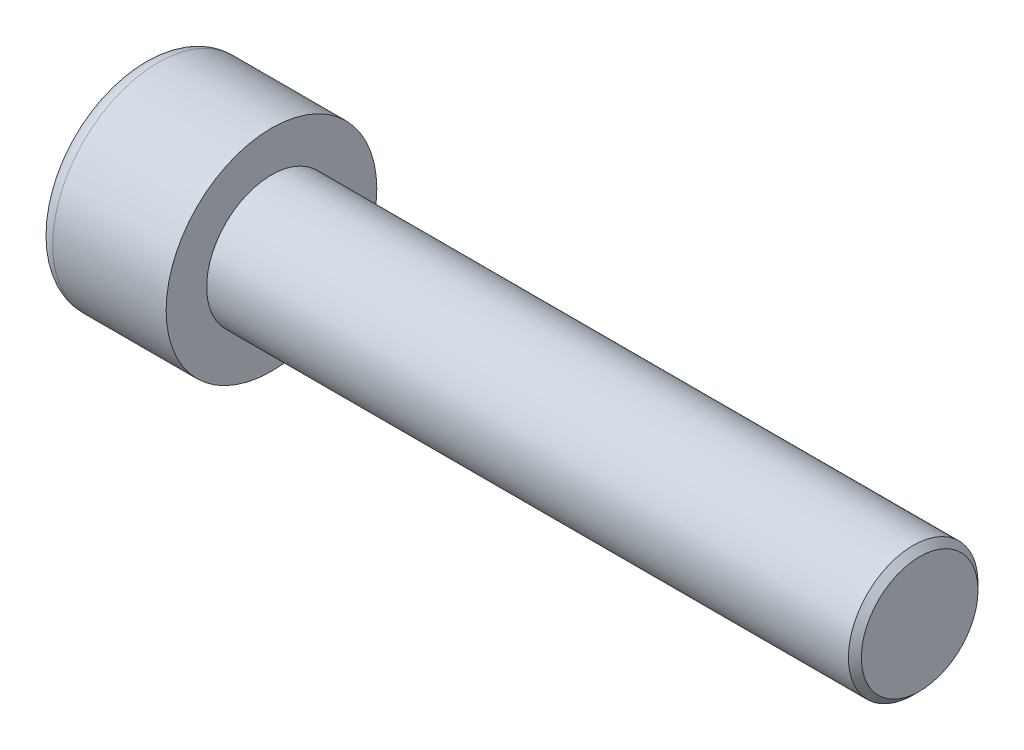
ISO-10303-21;
HEADER;
FILE_DESCRIPTION(('STEP AP214'),'2;1');
FILE_NAME('part.step','',(''),(''),'','','');
FILE_SCHEMA(('AUTOMOTIVE_DESIGN { 1 0 10303 214 1 1 1 1 }'));
ENDSEC;
DATA;
#1=APPLICATION_CONTEXT('core data for automotive mechanical design processes');
#2=APPLICATION_PROTOCOL_DEFINITION('international standard','automotive_design',2000,#1);
#3=PRODUCT_CONTEXT('',#1,'mechanical');
#4=PRODUCT('Part','Part','',(#3));
#5=PRODUCT_RELATED_PRODUCT_CATEGORY('part','',(#4));
#6=PRODUCT_DEFINITION_FORMATION('','',#4);
#7=PRODUCT_DEFINITION_CONTEXT('part definition',#1,'design');
#8=PRODUCT_DEFINITION('design','',#6,#7);
#9=PRODUCT_DEFINITION_SHAPE('','',#8);
#10=(LENGTH_UNIT() NAMED_UNIT(*) SI_UNIT(.MILLI.,.METRE.));
#11=(NAMED_UNIT(*) PLANE_ANGLE_UNIT() SI_UNIT($,.RADIAN.));
#12=(NAMED_UNIT(*) SI_UNIT($,.STERADIAN.) SOLID_ANGLE_UNIT());
#13=UNCERTAINTY_MEASURE_WITH_UNIT(LENGTH_MEASURE(1.E-05),#10,'distance_accuracy_value','');
#14=(GEOMETRIC_REPRESENTATION_CONTEXT(3) GLOBAL_UNCERTAINTY_ASSIGNED_CONTEXT((#13)) GLOBAL_UNIT_ASSIGNED_CONTEXT((#10,
#11,#12)) REPRESENTATION_CONTEXT('',''));
#15=CARTESIAN_POINT('',(0.,0.,0.));
#16=DIRECTION('',(0.,0.,1.));
#17=DIRECTION('',(1.,0.,0.));
#18=AXIS2_PLACEMENT_3D('',#15,#16,#17);
#19=CARTESIAN_POINT('',(4.,-6.,0.));
#20=DIRECTION('',(-1.,0.,0.));
#21=DIRECTION('',(0.,0.,1.));
#22=AXIS2_PLACEMENT_3D('',#19,#20,#21);
#23=PLANE('',#22);
#24=DIRECTION('',(0.,-0.866025403784438,-0.500000000000001));
#25=VECTOR('',#24,1.);
#26=CARTESIAN_POINT('',(4.,0.,3.46410161513776));
#27=LINE('',#26,#25);
#28=CARTESIAN_POINT('',(4.,-1.5,2.59807621135332));
#29=VERTEX_POINT('',#28);
#30=CARTESIAN_POINT('',(4.,-3.,1.73205080756888));
#31=VERTEX_POINT('',#30);
#32=EDGE_CURVE('E159',#29,#31,#27,.T.);
#33=ORIENTED_EDGE('',*,*,#32,.F.);
#34=CARTESIAN_POINT('',(4.,0.,0.));
#35=DIRECTION('',(-1.,0.,0.));
#36=DIRECTION('',(0.,0.,1.));
#37=AXIS2_PLACEMENT_3D('',#34,#35,#36);
#38=CIRCLE('',#37,3.);
#39=CARTESIAN_POINT('',(4.,-3.,0.));
#40=VERTEX_POINT('',#39);
#41=EDGE_CURVE('E54',#29,#40,#38,.F.);
#42=ORIENTED_EDGE('',*,*,#41,.T.);
#43=DIRECTION('',(0.,0.,-1.));
#44=VECTOR('',#43,1.);
#45=CARTESIAN_POINT('',(4.,-3.,1.73205080756888));
#46=LINE('',#45,#44);
#47=EDGE_CURVE('E164',#31,#40,#46,.T.);
#48=ORIENTED_EDGE('',*,*,#47,.F.);
#49=EDGE_LOOP('',(#33,#42,#48));
#50=FACE_BOUND('',#49,.T.);
#51=ADVANCED_FACE('F39',(#50),#23,.T.);
#52=CARTESIAN_POINT('',(4.,-3.,-1.73205080756888));
#53=VERTEX_POINT('',#52);
#54=EDGE_CURVE('E163',#40,#53,#46,.T.);
#55=ORIENTED_EDGE('',*,*,#54,.F.);
#56=CARTESIAN_POINT('',(4.,-1.5,-2.59807621135332));
#57=VERTEX_POINT('',#56);
#58=EDGE_CURVE('E139',#40,#57,#38,.F.);
#59=ORIENTED_EDGE('',*,*,#58,.T.);
#60=DIRECTION('',(0.,0.866025403784439,-0.5));
#61=VECTOR('',#60,1.);
#62=CARTESIAN_POINT('',(4.,-3.,-1.73205080756888));
#63=LINE('',#62,#61);
#64=EDGE_CURVE('E147',#53,#57,#63,.T.);
#65=ORIENTED_EDGE('',*,*,#64,.F.);
#66=EDGE_LOOP('',(#55,#59,#65));
#67=FACE_BOUND('',#66,.T.);
#68=ADVANCED_FACE('F220',(#67),#23,.T.);
#69=CARTESIAN_POINT('',(4.,0.,-3.46410161513776));
#70=VERTEX_POINT('',#69);
#71=EDGE_CURVE('E137',#57,#70,#63,.T.);
#72=ORIENTED_EDGE('',*,*,#71,.F.);
#73=CARTESIAN_POINT('',(4.,1.5,-2.59807621135332));
#74=VERTEX_POINT('',#73);
#75=EDGE_CURVE('E121',#57,#74,#38,.F.);
#76=ORIENTED_EDGE('',*,*,#75,.T.);
#77=DIRECTION('',(0.,0.866025403784439,0.5));
#78=VECTOR('',#77,1.);
#79=CARTESIAN_POINT('',(4.,0.,-3.46410161513776));
#80=LINE('',#79,#78);
#81=EDGE_CURVE('E135',#70,#74,#80,.T.);
#82=ORIENTED_EDGE('',*,*,#81,.F.);
#83=EDGE_LOOP('',(#72,#76,#82));
#84=FACE_BOUND('',#83,.T.);
#85=ADVANCED_FACE('F133',(#84),#23,.T.);
#86=CARTESIAN_POINT('',(4.,3.,-1.73205080756888));
#87=VERTEX_POINT('',#86);
#88=EDGE_CURVE('E141',#74,#87,#80,.T.);
#89=ORIENTED_EDGE('',*,*,#88,.F.);
#90=CARTESIAN_POINT('',(4.,0.,0.));
#91=DIRECTION('',(1.,0.,0.));
#92=DIRECTION('',(0.,0.,-1.));
#93=AXIS2_PLACEMENT_3D('',#90,#91,#92);
#94=CIRCLE('',#93,3.);
#95=CARTESIAN_POINT('',(4.,3.,0.));
#96=VERTEX_POINT('',#95);
#97=EDGE_CURVE('E119',#74,#96,#94,.T.);
#98=ORIENTED_EDGE('',*,*,#97,.T.);
#99=DIRECTION('',(0.,0.,1.));
#100=VECTOR('',#99,1.);
#101=CARTESIAN_POINT('',(4.,3.,-1.73205080756888));
#102=LINE('',#101,#100);
#103=EDGE_CURVE('E144',#87,#96,#102,.T.);
#104=ORIENTED_EDGE('',*,*,#103,.F.);
#105=EDGE_LOOP('',(#89,#98,#104));
#106=FACE_BOUND('',#105,.T.);
#107=ADVANCED_FACE('F142',(#106),#23,.T.);
#108=CARTESIAN_POINT('',(4.,3.,1.73205080756888));
#109=VERTEX_POINT('',#108);
#110=EDGE_CURVE('E151',#96,#109,#102,.T.);
#111=ORIENTED_EDGE('',*,*,#110,.F.);
#112=CARTESIAN_POINT('',(4.,1.5,2.59807621135332));
#113=VERTEX_POINT('',#112);
#114=EDGE_CURVE('E124',#96,#113,#38,.F.);
#115=ORIENTED_EDGE('',*,*,#114,.T.);
#116=DIRECTION('',(0.,-0.866025403784439,0.5));
#117=VECTOR('',#116,1.);
#118=CARTESIAN_POINT('',(4.,3.,1.73205080756888));
#119=LINE('',#118,#117);
#120=EDGE_CURVE('E156',#109,#113,#119,.T.);
#121=ORIENTED_EDGE('',*,*,#120,.F.);
#122=EDGE_LOOP('',(#111,#115,#121));
#123=FACE_BOUND('',#122,.T.);
#124=ADVANCED_FACE('F232',(#123),#23,.T.);
#125=CARTESIAN_POINT('',(4.,0.,3.46410161513776));
#126=VERTEX_POINT('',#125);
#127=EDGE_CURVE('E155',#113,#126,#119,.T.);
#128=ORIENTED_EDGE('',*,*,#127,.F.);
#129=EDGE_CURVE('E200',#113,#29,#38,.F.);
#130=ORIENTED_EDGE('',*,*,#129,.T.);
#131=EDGE_CURVE('E160',#126,#29,#27,.T.);
#132=ORIENTED_EDGE('',*,*,#131,.F.);
#133=EDGE_LOOP('',(#128,#130,#132));
#134=FACE_BOUND('',#133,.T.);
#135=ADVANCED_FACE('F223',(#134),#23,.T.);
#136=CARTESIAN_POINT('',(0.,0.,0.));
#137=DIRECTION('',(1.,0.,0.));
#138=DIRECTION('',(0.,0.,-1.));
#139=AXIS2_PLACEMENT_3D('',#136,#137,#138);
#140=PLANE('',#139);
#141=CARTESIAN_POINT('',(0.,0.,0.));
#142=DIRECTION('',(1.,0.,0.));
#143=DIRECTION('',(0.,0.,-1.));
#144=AXIS2_PLACEMENT_3D('',#141,#142,#143);
#145=CIRCLE('',#144,5.5);
#146=CARTESIAN_POINT('',(0.,0.,-5.5));
#147=VERTEX_POINT('',#146);
#148=EDGE_CURVE('E205',#147,#147,#145,.F.);
#149=ORIENTED_EDGE('',*,*,#148,.T.);
#150=EDGE_LOOP('',(#149));
#151=FACE_BOUND('',#150,.T.);
#152=DIRECTION('',(0.,0.866025403784439,-0.5));
#153=VECTOR('',#152,1.);
#154=CARTESIAN_POINT('',(0.,-3.,-1.73205080756888));
#155=LINE('',#154,#153);
#156=CARTESIAN_POINT('',(0.,-3.,-1.73205080756888));
#157=VERTEX_POINT('',#156);
#158=CARTESIAN_POINT('',(0.,0.,-3.46410161513776));
#159=VERTEX_POINT('',#158);
#160=EDGE_CURVE('E62',#157,#159,#155,.T.);
#161=ORIENTED_EDGE('',*,*,#160,.T.);
#162=DIRECTION('',(0.,0.866025403784439,0.5));
#163=VECTOR('',#162,1.);
#164=CARTESIAN_POINT('',(0.,0.,-3.46410161513776));
#165=LINE('',#164,#163);
#166=CARTESIAN_POINT('',(0.,3.,-1.73205080756888));
#167=VERTEX_POINT('',#166);
#168=EDGE_CURVE('E169',#159,#167,#165,.T.);
#169=ORIENTED_EDGE('',*,*,#168,.T.);
#170=DIRECTION('',(0.,0.,1.));
#171=VECTOR('',#170,1.);
#172=CARTESIAN_POINT('',(0.,3.,-1.73205080756888));
#173=LINE('',#172,#171);
#174=CARTESIAN_POINT('',(0.,3.,1.73205080756888));
#175=VERTEX_POINT('',#174);
#176=EDGE_CURVE('E172',#167,#175,#173,.T.);
#177=ORIENTED_EDGE('',*,*,#176,.T.);
#178=DIRECTION('',(0.,-0.866025403784439,0.5));
#179=VECTOR('',#178,1.);
#180=CARTESIAN_POINT('',(0.,3.,1.73205080756888));
#181=LINE('',#180,#179);
#182=CARTESIAN_POINT('',(0.,0.,3.46410161513776));
#183=VERTEX_POINT('',#182);
#184=EDGE_CURVE('E175',#175,#183,#181,.T.);
#185=ORIENTED_EDGE('',*,*,#184,.T.);
#186=DIRECTION('',(0.,-0.866025403784438,-0.500000000000001));
#187=VECTOR('',#186,1.);
#188=CARTESIAN_POINT('',(0.,0.,3.46410161513776));
#189=LINE('',#188,#187);
#190=CARTESIAN_POINT('',(0.,-3.,1.73205080756888));
#191=VERTEX_POINT('',#190);
#192=EDGE_CURVE('E178',#183,#191,#189,.T.);
#193=ORIENTED_EDGE('',*,*,#192,.T.);
#194=DIRECTION('',(0.,0.,-1.));
#195=VECTOR('',#194,1.);
#196=CARTESIAN_POINT('',(0.,-3.,1.73205080756888));
#197=LINE('',#196,#195);
#198=EDGE_CURVE('E181',#191,#157,#197,.T.);
#199=ORIENTED_EDGE('',*,*,#198,.T.);
#200=EDGE_LOOP('',(#161,#169,#177,#185,#193,#199));
#201=FACE_BOUND('',#200,.T.);
#202=ADVANCED_FACE('F231',(#151,#201),#140,.F.);
#203=CARTESIAN_POINT('',(8.,0.,0.));
#204=DIRECTION('',(1.,0.,0.));
#205=DIRECTION('',(0.,0.,-1.));
#206=AXIS2_PLACEMENT_3D('',#203,#204,#205);
#207=PLANE('',#206);
#208=CARTESIAN_POINT('',(8.,0.,0.));
#209=DIRECTION('',(1.,0.,0.));
#210=DIRECTION('',(0.,0.,-1.));
#211=AXIS2_PLACEMENT_3D('',#208,#209,#210);
#212=CIRCLE('',#211,6.5);
#213=CARTESIAN_POINT('',(8.,0.,-6.5));
#214=VERTEX_POINT('',#213);
#215=EDGE_CURVE('E197',#214,#214,#212,.T.);
#216=ORIENTED_EDGE('',*,*,#215,.T.);
#217=EDGE_LOOP('',(#216));
#218=FACE_BOUND('',#217,.T.);
#219=CARTESIAN_POINT('',(8.,0.,0.));
#220=DIRECTION('',(1.,0.,0.));
#221=DIRECTION('',(0.,0.,-1.));
#222=AXIS2_PLACEMENT_3D('',#219,#220,#221);
#223=CIRCLE('',#222,4.);
#224=CARTESIAN_POINT('',(8.,0.,-4.));
#225=VERTEX_POINT('',#224);
#226=EDGE_CURVE('E194',#225,#225,#223,.T.);
#227=ORIENTED_EDGE('',*,*,#226,.F.);
#228=EDGE_LOOP('',(#227));
#229=FACE_BOUND('',#228,.T.);
#230=ADVANCED_FACE('F238',(#218,#229),#207,.T.);
#231=CARTESIAN_POINT('',(8.,0.,0.));
#232=DIRECTION('',(-1.,0.,0.));
#233=DIRECTION('',(0.,0.,1.));
#234=AXIS2_PLACEMENT_3D('',#231,#232,#233);
#235=CYLINDRICAL_SURFACE('',#234,6.5);
#236=CARTESIAN_POINT('',(1.,0.,0.));
#237=DIRECTION('',(1.,0.,0.));
#238=DIRECTION('',(0.,0.,-1.));
#239=AXIS2_PLACEMENT_3D('',#236,#237,#238);
#240=CIRCLE('',#239,6.5);
#241=CARTESIAN_POINT('',(1.,0.,-6.5));
#242=VERTEX_POINT('',#241);
#243=EDGE_CURVE('E202',#242,#242,#240,.T.);
#244=ORIENTED_EDGE('',*,*,#243,.T.);
#245=EDGE_LOOP('',(#244));
#246=FACE_BOUND('',#245,.T.);
#247=ORIENTED_EDGE('',*,*,#215,.F.);
#248=EDGE_LOOP('',(#247));
#249=FACE_BOUND('',#248,.T.);
#250=ADVANCED_FACE('F283',(#246,#249),#235,.T.);
#251=CARTESIAN_POINT('',(48.,0.,0.));
#252=DIRECTION('',(-1.,0.,0.));
#253=DIRECTION('',(0.,0.,1.));
#254=AXIS2_PLACEMENT_3D('',#251,#252,#253);
#255=CYLINDRICAL_SURFACE('',#254,4.);
#256=CARTESIAN_POINT('',(47.6,0.,0.));
#257=DIRECTION('',(1.,0.,0.));
#258=DIRECTION('',(0.,0.,-1.));
#259=AXIS2_PLACEMENT_3D('',#256,#257,#258);
#260=CIRCLE('',#259,4.);
#261=CARTESIAN_POINT('',(47.6,0.,-4.));
#262=VERTEX_POINT('',#261);
#263=EDGE_CURVE('E11',#262,#262,#260,.F.);
#264=ORIENTED_EDGE('',*,*,#263,.T.);
#265=EDGE_LOOP('',(#264));
#266=FACE_BOUND('',#265,.T.);
#267=ORIENTED_EDGE('',*,*,#226,.T.);
#268=EDGE_LOOP('',(#267));
#269=FACE_BOUND('',#268,.T.);
#270=ADVANCED_FACE('F280',(#266,#269),#255,.T.);
#271=CARTESIAN_POINT('',(48.,0.,0.));
#272=DIRECTION('',(1.,0.,0.));
#273=DIRECTION('',(0.,0.,-1.));
#274=AXIS2_PLACEMENT_3D('',#271,#272,#273);
#275=PLANE('',#274);
#276=CARTESIAN_POINT('',(48.,0.,0.));
#277=DIRECTION('',(1.,0.,0.));
#278=DIRECTION('',(0.,0.,-1.));
#279=AXIS2_PLACEMENT_3D('',#276,#277,#278);
#280=CIRCLE('',#279,3.60000000000001);
#281=CARTESIAN_POINT('',(48.,0.,-3.60000000000001));
#282=VERTEX_POINT('',#281);
#283=EDGE_CURVE('E47',#282,#282,#280,.T.);
#284=ORIENTED_EDGE('',*,*,#283,.T.);
#285=EDGE_LOOP('',(#284));
#286=FACE_BOUND('',#285,.T.);
#287=ADVANCED_FACE('F210',(#286),#275,.T.);
#288=CARTESIAN_POINT('',(4.,-3.,-1.73205080756888));
#289=DIRECTION('',(0.,0.5,0.866025403784439));
#290=DIRECTION('',(0.,-0.866025403784439,0.5));
#291=AXIS2_PLACEMENT_3D('',#288,#289,#290);
#292=PLANE('',#291);
#293=ORIENTED_EDGE('',*,*,#160,.F.);
#294=DIRECTION('',(-1.,0.,0.));
#295=VECTOR('',#294,1.);
#296=CARTESIAN_POINT('',(4.,-3.,-1.73205080756888));
#297=LINE('',#296,#295);
#298=EDGE_CURVE('E167',#53,#157,#297,.T.);
#299=ORIENTED_EDGE('',*,*,#298,.F.);
#300=ORIENTED_EDGE('',*,*,#64,.T.);
#301=ORIENTED_EDGE('',*,*,#71,.T.);
#302=DIRECTION('',(-1.,0.,0.));
#303=VECTOR('',#302,1.);
#304=CARTESIAN_POINT('',(4.,0.,-3.46410161513776));
#305=LINE('',#304,#303);
#306=EDGE_CURVE('E150',#70,#159,#305,.T.);
#307=ORIENTED_EDGE('',*,*,#306,.T.);
#308=EDGE_LOOP('',(#293,#299,#300,#301,#307));
#309=FACE_BOUND('',#308,.T.);
#310=ADVANCED_FACE('F254',(#309),#292,.T.);
#311=CARTESIAN_POINT('',(4.,0.,-3.46410161513776));
#312=DIRECTION('',(0.,-0.5,0.866025403784439));
#313=DIRECTION('',(0.,-0.866025403784439,-0.5));
#314=AXIS2_PLACEMENT_3D('',#311,#312,#313);
#315=PLANE('',#314);
#316=ORIENTED_EDGE('',*,*,#168,.F.);
#317=ORIENTED_EDGE('',*,*,#306,.F.);
#318=ORIENTED_EDGE('',*,*,#81,.T.);
#319=ORIENTED_EDGE('',*,*,#88,.T.);
#320=DIRECTION('',(-1.,0.,0.));
#321=VECTOR('',#320,1.);
#322=CARTESIAN_POINT('',(4.,3.,-1.73205080756888));
#323=LINE('',#322,#321);
#324=EDGE_CURVE('E191',#87,#167,#323,.T.);
#325=ORIENTED_EDGE('',*,*,#324,.T.);
#326=EDGE_LOOP('',(#316,#317,#318,#319,#325));
#327=FACE_BOUND('',#326,.T.);
#328=ADVANCED_FACE('F149',(#327),#315,.T.);
#329=CARTESIAN_POINT('',(4.,3.,-1.73205080756888));
#330=DIRECTION('',(0.,-1.,0.));
#331=DIRECTION('',(0.,0.,-1.));
#332=AXIS2_PLACEMENT_3D('',#329,#330,#331);
#333=PLANE('',#332);
#334=ORIENTED_EDGE('',*,*,#176,.F.);
#335=ORIENTED_EDGE('',*,*,#324,.F.);
#336=ORIENTED_EDGE('',*,*,#103,.T.);
#337=ORIENTED_EDGE('',*,*,#110,.T.);
#338=DIRECTION('',(-1.,0.,0.));
#339=VECTOR('',#338,1.);
#340=CARTESIAN_POINT('',(4.,3.,1.73205080756888));
#341=LINE('',#340,#339);
#342=EDGE_CURVE('E189',#109,#175,#341,.T.);
#343=ORIENTED_EDGE('',*,*,#342,.T.);
#344=EDGE_LOOP('',(#334,#335,#336,#337,#343));
#345=FACE_BOUND('',#344,.T.);
#346=ADVANCED_FACE('F252',(#345),#333,.T.);
#347=CARTESIAN_POINT('',(4.,3.,1.73205080756888));
#348=DIRECTION('',(0.,-0.5,-0.866025403784439));
#349=DIRECTION('',(0.,0.866025403784439,-0.5));
#350=AXIS2_PLACEMENT_3D('',#347,#348,#349);
#351=PLANE('',#350);
#352=ORIENTED_EDGE('',*,*,#184,.F.);
#353=ORIENTED_EDGE('',*,*,#342,.F.);
#354=ORIENTED_EDGE('',*,*,#120,.T.);
#355=ORIENTED_EDGE('',*,*,#127,.T.);
#356=DIRECTION('',(-1.,0.,0.));
#357=VECTOR('',#356,1.);
#358=CARTESIAN_POINT('',(4.,0.,3.46410161513776));
#359=LINE('',#358,#357);
#360=EDGE_CURVE('E187',#126,#183,#359,.T.);
#361=ORIENTED_EDGE('',*,*,#360,.T.);
#362=EDGE_LOOP('',(#352,#353,#354,#355,#361));
#363=FACE_BOUND('',#362,.T.);
#364=ADVANCED_FACE('F249',(#363),#351,.T.);
#365=CARTESIAN_POINT('',(4.,0.,3.46410161513776));
#366=DIRECTION('',(0.,0.500000000000001,-0.866025403784438));
#367=DIRECTION('',(0.,0.866025403784438,0.500000000000001));
#368=AXIS2_PLACEMENT_3D('',#365,#366,#367);
#369=PLANE('',#368);
#370=ORIENTED_EDGE('',*,*,#192,.F.);
#371=ORIENTED_EDGE('',*,*,#360,.F.);
#372=ORIENTED_EDGE('',*,*,#131,.T.);
#373=ORIENTED_EDGE('',*,*,#32,.T.);
#374=DIRECTION('',(-1.,0.,0.));
#375=VECTOR('',#374,1.);
#376=CARTESIAN_POINT('',(4.,-3.,1.73205080756888));
#377=LINE('',#376,#375);
#378=EDGE_CURVE('E185',#31,#191,#377,.T.);
#379=ORIENTED_EDGE('',*,*,#378,.T.);
#380=EDGE_LOOP('',(#370,#371,#372,#373,#379));
#381=FACE_BOUND('',#380,.T.);
#382=ADVANCED_FACE('F263',(#381),#369,.T.);
#383=CARTESIAN_POINT('',(4.,-3.,1.73205080756888));
#384=DIRECTION('',(0.,1.,0.));
#385=DIRECTION('',(0.,0.,1.));
#386=AXIS2_PLACEMENT_3D('',#383,#384,#385);
#387=PLANE('',#386);
#388=ORIENTED_EDGE('',*,*,#198,.F.);
#389=ORIENTED_EDGE('',*,*,#378,.F.);
#390=ORIENTED_EDGE('',*,*,#47,.T.);
#391=ORIENTED_EDGE('',*,*,#54,.T.);
#392=ORIENTED_EDGE('',*,*,#298,.T.);
#393=EDGE_LOOP('',(#388,#389,#390,#391,#392));
#394=FACE_BOUND('',#393,.T.);
#395=ADVANCED_FACE('F116',(#394),#387,.T.);
#396=CARTESIAN_POINT('',(4.,0.,0.));
#397=DIRECTION('',(-1.,0.,0.));
#398=DIRECTION('',(0.,0.,1.));
#399=AXIS2_PLACEMENT_3D('',#396,#397,#398);
#400=CONICAL_SURFACE('',#399,3.,1.04719755119659);
#401=CARTESIAN_POINT('',(5.7320508075689,0.,0.));
#402=VERTEX_POINT('',#401);
#403=VERTEX_LOOP('',#402);
#404=FACE_BOUND('',#403,.T.);
#405=ORIENTED_EDGE('',*,*,#97,.F.);
#406=ORIENTED_EDGE('',*,*,#75,.F.);
#407=ORIENTED_EDGE('',*,*,#58,.F.);
#408=ORIENTED_EDGE('',*,*,#41,.F.);
#409=ORIENTED_EDGE('',*,*,#129,.F.);
#410=ORIENTED_EDGE('',*,*,#114,.F.);
#411=EDGE_LOOP('',(#405,#406,#407,#408,#409,#410));
#412=FACE_BOUND('',#411,.T.);
#413=ADVANCED_FACE('F113',(#404,#412),#400,.F.);
#414=CARTESIAN_POINT('',(1.,0.,0.));
#415=DIRECTION('',(1.,0.,0.));
#416=DIRECTION('',(0.,0.,-1.));
#417=AXIS2_PLACEMENT_3D('',#414,#415,#416);
#418=TOROIDAL_SURFACE('',#417,5.5,1.);
#419=ORIENTED_EDGE('',*,*,#148,.F.);
#420=EDGE_LOOP('',(#419));
#421=FACE_BOUND('',#420,.T.);
#422=ORIENTED_EDGE('',*,*,#243,.F.);
#423=EDGE_LOOP('',(#422));
#424=FACE_BOUND('',#423,.T.);
#425=ADVANCED_FACE('F115',(#421,#424),#418,.T.);
#426=CARTESIAN_POINT('',(48.,0.,0.));
#427=DIRECTION('',(-1.,0.,0.));
#428=DIRECTION('',(0.,0.,1.));
#429=AXIS2_PLACEMENT_3D('',#426,#427,#428);
#430=CONICAL_SURFACE('',#429,3.60000000000001,0.785398163397444);
#431=ORIENTED_EDGE('',*,*,#263,.F.);
#432=EDGE_LOOP('',(#431));
#433=FACE_BOUND('',#432,.T.);
#434=ORIENTED_EDGE('',*,*,#283,.F.);
#435=EDGE_LOOP('',(#434));
#436=FACE_BOUND('',#435,.T.);
#437=ADVANCED_FACE('F41',(#433,#436),#430,.T.);
#438=CLOSED_SHELL('',(#51,#68,#85,#107,#124,#135,#202,#230,#250,#270,#287,#310,#328,#346,#364,
#382,#395,#413,#425,#437));
#439=MANIFOLD_SOLID_BREP('B2',#438);
#440=ADVANCED_BREP_SHAPE_REPRESENTATION('',(#18,#439),#14);
#441=SHAPE_DEFINITION_REPRESENTATION(#9,#440);
ENDSEC;
END-ISO-10303-21;
